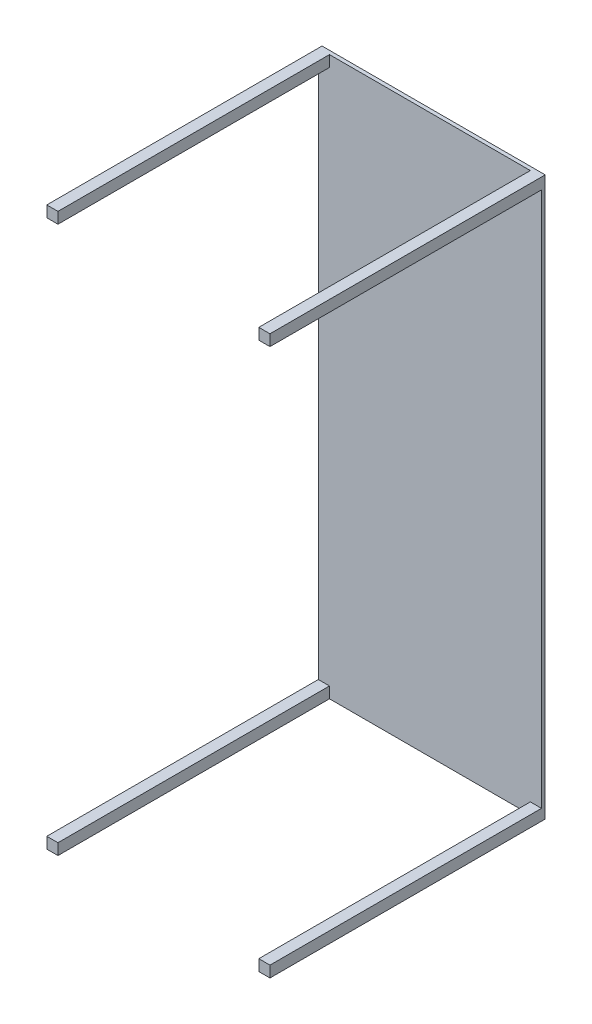
ISO-10303-21;
HEADER;
FILE_DESCRIPTION(('STEP AP214'),'2;1');
FILE_NAME('part.step','',(''),(''),'','','');
FILE_SCHEMA(('AUTOMOTIVE_DESIGN { 1 0 10303 214 1 1 1 1 }'));
ENDSEC;
DATA;
#1=APPLICATION_CONTEXT('core data for automotive mechanical design processes');
#2=APPLICATION_PROTOCOL_DEFINITION('international standard','automotive_design',2000,#1);
#3=PRODUCT_CONTEXT('',#1,'mechanical');
#4=PRODUCT('Part','Part','',(#3));
#5=PRODUCT_RELATED_PRODUCT_CATEGORY('part','',(#4));
#6=PRODUCT_DEFINITION_FORMATION('','',#4);
#7=PRODUCT_DEFINITION_CONTEXT('part definition',#1,'design');
#8=PRODUCT_DEFINITION('design','',#6,#7);
#9=PRODUCT_DEFINITION_SHAPE('','',#8);
#10=(LENGTH_UNIT() NAMED_UNIT(*) SI_UNIT(.MILLI.,.METRE.));
#11=(NAMED_UNIT(*) PLANE_ANGLE_UNIT() SI_UNIT($,.RADIAN.));
#12=(NAMED_UNIT(*) SI_UNIT($,.STERADIAN.) SOLID_ANGLE_UNIT());
#13=UNCERTAINTY_MEASURE_WITH_UNIT(LENGTH_MEASURE(1.E-05),#10,'distance_accuracy_value','');
#14=(GEOMETRIC_REPRESENTATION_CONTEXT(3) GLOBAL_UNCERTAINTY_ASSIGNED_CONTEXT((#13)) GLOBAL_UNIT_ASSIGNED_CONTEXT((#10,
#11,#12)) REPRESENTATION_CONTEXT('',''));
#15=CARTESIAN_POINT('',(0.,0.,0.));
#16=DIRECTION('',(0.,0.,1.));
#17=DIRECTION('',(1.,0.,0.));
#18=AXIS2_PLACEMENT_3D('',#15,#16,#17);
#19=CARTESIAN_POINT('',(0.,0.,10.));
#20=DIRECTION('',(0.,0.,1.));
#21=DIRECTION('',(1.,0.,0.));
#22=AXIS2_PLACEMENT_3D('',#19,#20,#21);
#23=PLANE('',#22);
#24=DIRECTION('',(-1.,0.,0.));
#25=VECTOR('',#24,1.);
#26=CARTESIAN_POINT('',(-300.,-720.,10.));
#27=LINE('',#26,#25);
#28=CARTESIAN_POINT('',(-270.,-720.,10.));
#29=VERTEX_POINT('',#28);
#30=CARTESIAN_POINT('',(-300.,-720.,10.));
#31=VERTEX_POINT('',#30);
#32=EDGE_CURVE('E50',#29,#31,#27,.T.);
#33=ORIENTED_EDGE('',*,*,#32,.F.);
#34=DIRECTION('',(0.,1.,0.));
#35=VECTOR('',#34,1.);
#36=CARTESIAN_POINT('',(-270.,-720.,10.));
#37=LINE('',#36,#35);
#38=CARTESIAN_POINT('',(-270.,-750.,10.));
#39=VERTEX_POINT('',#38);
#40=EDGE_CURVE('E174',#39,#29,#37,.T.);
#41=ORIENTED_EDGE('',*,*,#40,.F.);
#42=DIRECTION('',(1.,0.,0.));
#43=VECTOR('',#42,1.);
#44=CARTESIAN_POINT('',(-300.,-750.,10.));
#45=LINE('',#44,#43);
#46=CARTESIAN_POINT('',(270.,-750.,10.));
#47=VERTEX_POINT('',#46);
#48=EDGE_CURVE('E282',#39,#47,#45,.T.);
#49=ORIENTED_EDGE('',*,*,#48,.T.);
#50=DIRECTION('',(0.,-1.,0.));
#51=VECTOR('',#50,1.);
#52=CARTESIAN_POINT('',(270.,-720.,10.));
#53=LINE('',#52,#51);
#54=CARTESIAN_POINT('',(270.,-720.,10.));
#55=VERTEX_POINT('',#54);
#56=EDGE_CURVE('E186',#55,#47,#53,.T.);
#57=ORIENTED_EDGE('',*,*,#56,.F.);
#58=DIRECTION('',(-1.,0.,0.));
#59=VECTOR('',#58,1.);
#60=CARTESIAN_POINT('',(270.,-720.,10.));
#61=LINE('',#60,#59);
#62=CARTESIAN_POINT('',(300.,-720.,10.));
#63=VERTEX_POINT('',#62);
#64=EDGE_CURVE('E191',#63,#55,#61,.T.);
#65=ORIENTED_EDGE('',*,*,#64,.F.);
#66=DIRECTION('',(0.,1.,0.));
#67=VECTOR('',#66,1.);
#68=CARTESIAN_POINT('',(300.,750.,10.));
#69=LINE('',#68,#67);
#70=CARTESIAN_POINT('',(300.,720.,10.));
#71=VERTEX_POINT('',#70);
#72=EDGE_CURVE('E292',#63,#71,#69,.T.);
#73=ORIENTED_EDGE('',*,*,#72,.T.);
#74=DIRECTION('',(1.,0.,0.));
#75=VECTOR('',#74,1.);
#76=CARTESIAN_POINT('',(270.,720.,10.));
#77=LINE('',#76,#75);
#78=CARTESIAN_POINT('',(270.,720.,10.));
#79=VERTEX_POINT('',#78);
#80=EDGE_CURVE('E216',#79,#71,#77,.T.);
#81=ORIENTED_EDGE('',*,*,#80,.F.);
#82=DIRECTION('',(0.,-1.,0.));
#83=VECTOR('',#82,1.);
#84=CARTESIAN_POINT('',(270.,750.,10.));
#85=LINE('',#84,#83);
#86=CARTESIAN_POINT('',(270.,750.,10.));
#87=VERTEX_POINT('',#86);
#88=EDGE_CURVE('E211',#87,#79,#85,.T.);
#89=ORIENTED_EDGE('',*,*,#88,.F.);
#90=DIRECTION('',(-1.,0.,0.));
#91=VECTOR('',#90,1.);
#92=CARTESIAN_POINT('',(-300.,750.,10.));
#93=LINE('',#92,#91);
#94=CARTESIAN_POINT('',(-270.,750.,10.));
#95=VERTEX_POINT('',#94);
#96=EDGE_CURVE('E36',#87,#95,#93,.T.);
#97=ORIENTED_EDGE('',*,*,#96,.T.);
#98=DIRECTION('',(0.,1.,0.));
#99=VECTOR('',#98,1.);
#100=CARTESIAN_POINT('',(-270.,750.,10.));
#101=LINE('',#100,#99);
#102=CARTESIAN_POINT('',(-270.,720.,10.));
#103=VERTEX_POINT('',#102);
#104=EDGE_CURVE('E241',#103,#95,#101,.T.);
#105=ORIENTED_EDGE('',*,*,#104,.F.);
#106=DIRECTION('',(1.,0.,0.));
#107=VECTOR('',#106,1.);
#108=CARTESIAN_POINT('',(-300.,720.,10.));
#109=LINE('',#108,#107);
#110=CARTESIAN_POINT('',(-300.,720.,10.));
#111=VERTEX_POINT('',#110);
#112=EDGE_CURVE('E236',#111,#103,#109,.T.);
#113=ORIENTED_EDGE('',*,*,#112,.F.);
#114=DIRECTION('',(0.,-1.,0.));
#115=VECTOR('',#114,1.);
#116=CARTESIAN_POINT('',(-300.,750.,10.));
#117=LINE('',#116,#115);
#118=EDGE_CURVE('E55',#111,#31,#117,.T.);
#119=ORIENTED_EDGE('',*,*,#118,.T.);
#120=EDGE_LOOP('',(#33,#41,#49,#57,#65,#73,#81,#89,#97,#105,#113,#119));
#121=FACE_BOUND('',#120,.T.);
#122=ADVANCED_FACE('F32',(#121),#23,.T.);
#123=CARTESIAN_POINT('',(300.,750.,10.));
#124=DIRECTION('',(-1.,0.,0.));
#125=DIRECTION('',(0.,-1.,0.));
#126=AXIS2_PLACEMENT_3D('',#123,#124,#125);
#127=PLANE('',#126);
#128=DIRECTION('',(0.,1.,0.));
#129=VECTOR('',#128,1.);
#130=CARTESIAN_POINT('',(300.,750.,0.));
#131=LINE('',#130,#129);
#132=CARTESIAN_POINT('',(300.,-750.,0.));
#133=VERTEX_POINT('',#132);
#134=CARTESIAN_POINT('',(300.,750.,0.));
#135=VERTEX_POINT('',#134);
#136=EDGE_CURVE('E270',#133,#135,#131,.T.);
#137=ORIENTED_EDGE('',*,*,#136,.T.);
#138=DIRECTION('',(0.,0.,-1.));
#139=VECTOR('',#138,1.);
#140=CARTESIAN_POINT('',(300.,750.,10.));
#141=LINE('',#140,#139);
#142=CARTESIAN_POINT('',(300.,750.,740.));
#143=VERTEX_POINT('',#142);
#144=EDGE_CURVE('E11',#143,#135,#141,.T.);
#145=ORIENTED_EDGE('',*,*,#144,.F.);
#146=DIRECTION('',(0.,1.,0.));
#147=VECTOR('',#146,1.);
#148=CARTESIAN_POINT('',(300.,750.,740.));
#149=LINE('',#148,#147);
#150=CARTESIAN_POINT('',(300.,720.,740.));
#151=VERTEX_POINT('',#150);
#152=EDGE_CURVE('E218',#151,#143,#149,.T.);
#153=ORIENTED_EDGE('',*,*,#152,.F.);
#154=DIRECTION('',(0.,0.,-1.));
#155=VECTOR('',#154,1.);
#156=CARTESIAN_POINT('',(300.,720.,740.));
#157=LINE('',#156,#155);
#158=EDGE_CURVE('E230',#151,#71,#157,.T.);
#159=ORIENTED_EDGE('',*,*,#158,.T.);
#160=ORIENTED_EDGE('',*,*,#72,.F.);
#161=DIRECTION('',(0.,0.,-1.));
#162=VECTOR('',#161,1.);
#163=CARTESIAN_POINT('',(300.,-720.,740.));
#164=LINE('',#163,#162);
#165=CARTESIAN_POINT('',(300.,-720.,740.));
#166=VERTEX_POINT('',#165);
#167=EDGE_CURVE('E205',#166,#63,#164,.T.);
#168=ORIENTED_EDGE('',*,*,#167,.F.);
#169=DIRECTION('',(0.,1.,0.));
#170=VECTOR('',#169,1.);
#171=CARTESIAN_POINT('',(300.,-720.,740.));
#172=LINE('',#171,#170);
#173=CARTESIAN_POINT('',(300.,-750.,740.));
#174=VERTEX_POINT('',#173);
#175=EDGE_CURVE('E194',#174,#166,#172,.T.);
#176=ORIENTED_EDGE('',*,*,#175,.F.);
#177=DIRECTION('',(0.,0.,-1.));
#178=VECTOR('',#177,1.);
#179=CARTESIAN_POINT('',(300.,-750.,10.));
#180=LINE('',#179,#178);
#181=EDGE_CURVE('E158',#174,#133,#180,.T.);
#182=ORIENTED_EDGE('',*,*,#181,.T.);
#183=EDGE_LOOP('',(#137,#145,#153,#159,#160,#168,#176,#182));
#184=FACE_BOUND('',#183,.T.);
#185=ADVANCED_FACE('F34',(#184),#127,.F.);
#186=CARTESIAN_POINT('',(-300.,750.,10.));
#187=DIRECTION('',(0.,-1.,0.));
#188=DIRECTION('',(0.,0.,-1.));
#189=AXIS2_PLACEMENT_3D('',#186,#187,#188);
#190=PLANE('',#189);
#191=DIRECTION('',(-1.,0.,0.));
#192=VECTOR('',#191,1.);
#193=CARTESIAN_POINT('',(-300.,750.,0.));
#194=LINE('',#193,#192);
#195=CARTESIAN_POINT('',(-300.,750.,0.));
#196=VERTEX_POINT('',#195);
#197=EDGE_CURVE('E275',#135,#196,#194,.T.);
#198=ORIENTED_EDGE('',*,*,#197,.T.);
#199=DIRECTION('',(0.,0.,-1.));
#200=VECTOR('',#199,1.);
#201=CARTESIAN_POINT('',(-300.,750.,10.));
#202=LINE('',#201,#200);
#203=CARTESIAN_POINT('',(-300.,750.,740.));
#204=VERTEX_POINT('',#203);
#205=EDGE_CURVE('E42',#204,#196,#202,.T.);
#206=ORIENTED_EDGE('',*,*,#205,.F.);
#207=DIRECTION('',(-1.,0.,0.));
#208=VECTOR('',#207,1.);
#209=CARTESIAN_POINT('',(-300.,750.,740.));
#210=LINE('',#209,#208);
#211=CARTESIAN_POINT('',(-270.,750.,740.));
#212=VERTEX_POINT('',#211);
#213=EDGE_CURVE('E245',#212,#204,#210,.T.);
#214=ORIENTED_EDGE('',*,*,#213,.F.);
#215=DIRECTION('',(0.,0.,-1.));
#216=VECTOR('',#215,1.);
#217=CARTESIAN_POINT('',(-270.,750.,740.));
#218=LINE('',#217,#216);
#219=EDGE_CURVE('E248',#212,#95,#218,.T.);
#220=ORIENTED_EDGE('',*,*,#219,.T.);
#221=ORIENTED_EDGE('',*,*,#96,.F.);
#222=DIRECTION('',(0.,0.,-1.));
#223=VECTOR('',#222,1.);
#224=CARTESIAN_POINT('',(270.,750.,740.));
#225=LINE('',#224,#223);
#226=CARTESIAN_POINT('',(270.,750.,740.));
#227=VERTEX_POINT('',#226);
#228=EDGE_CURVE('E223',#227,#87,#225,.T.);
#229=ORIENTED_EDGE('',*,*,#228,.F.);
#230=DIRECTION('',(-1.,0.,0.));
#231=VECTOR('',#230,1.);
#232=CARTESIAN_POINT('',(270.,750.,740.));
#233=LINE('',#232,#231);
#234=EDGE_CURVE('E221',#143,#227,#233,.T.);
#235=ORIENTED_EDGE('',*,*,#234,.F.);
#236=ORIENTED_EDGE('',*,*,#144,.T.);
#237=EDGE_LOOP('',(#198,#206,#214,#220,#221,#229,#235,#236));
#238=FACE_BOUND('',#237,.T.);
#239=ADVANCED_FACE('F327',(#238),#190,.F.);
#240=CARTESIAN_POINT('',(-300.,750.,10.));
#241=DIRECTION('',(1.,0.,0.));
#242=DIRECTION('',(0.,1.,0.));
#243=AXIS2_PLACEMENT_3D('',#240,#241,#242);
#244=PLANE('',#243);
#245=DIRECTION('',(0.,-1.,0.));
#246=VECTOR('',#245,1.);
#247=CARTESIAN_POINT('',(-300.,750.,0.));
#248=LINE('',#247,#246);
#249=CARTESIAN_POINT('',(-300.,-750.,0.));
#250=VERTEX_POINT('',#249);
#251=EDGE_CURVE('E155',#196,#250,#248,.T.);
#252=ORIENTED_EDGE('',*,*,#251,.T.);
#253=DIRECTION('',(0.,0.,-1.));
#254=VECTOR('',#253,1.);
#255=CARTESIAN_POINT('',(-300.,-750.,10.));
#256=LINE('',#255,#254);
#257=CARTESIAN_POINT('',(-300.,-750.,740.));
#258=VERTEX_POINT('',#257);
#259=EDGE_CURVE('E147',#258,#250,#256,.T.);
#260=ORIENTED_EDGE('',*,*,#259,.F.);
#261=DIRECTION('',(0.,-1.,0.));
#262=VECTOR('',#261,1.);
#263=CARTESIAN_POINT('',(-300.,-720.,740.));
#264=LINE('',#263,#262);
#265=CARTESIAN_POINT('',(-300.,-720.,740.));
#266=VERTEX_POINT('',#265);
#267=EDGE_CURVE('E152',#266,#258,#264,.T.);
#268=ORIENTED_EDGE('',*,*,#267,.F.);
#269=DIRECTION('',(0.,0.,-1.));
#270=VECTOR('',#269,1.);
#271=CARTESIAN_POINT('',(-300.,-720.,740.));
#272=LINE('',#271,#270);
#273=EDGE_CURVE('E179',#266,#31,#272,.T.);
#274=ORIENTED_EDGE('',*,*,#273,.T.);
#275=ORIENTED_EDGE('',*,*,#118,.F.);
#276=DIRECTION('',(0.,0.,-1.));
#277=VECTOR('',#276,1.);
#278=CARTESIAN_POINT('',(-300.,720.,740.));
#279=LINE('',#278,#277);
#280=CARTESIAN_POINT('',(-300.,720.,740.));
#281=VERTEX_POINT('',#280);
#282=EDGE_CURVE('E265',#281,#111,#279,.T.);
#283=ORIENTED_EDGE('',*,*,#282,.F.);
#284=DIRECTION('',(0.,-1.,0.));
#285=VECTOR('',#284,1.);
#286=CARTESIAN_POINT('',(-300.,750.,740.));
#287=LINE('',#286,#285);
#288=EDGE_CURVE('E237',#204,#281,#287,.T.);
#289=ORIENTED_EDGE('',*,*,#288,.F.);
#290=ORIENTED_EDGE('',*,*,#205,.T.);
#291=EDGE_LOOP('',(#252,#260,#268,#274,#275,#283,#289,#290));
#292=FACE_BOUND('',#291,.T.);
#293=ADVANCED_FACE('F149',(#292),#244,.F.);
#294=CARTESIAN_POINT('',(-300.,-750.,10.));
#295=DIRECTION('',(0.,1.,0.));
#296=DIRECTION('',(0.,0.,1.));
#297=AXIS2_PLACEMENT_3D('',#294,#295,#296);
#298=PLANE('',#297);
#299=DIRECTION('',(1.,0.,0.));
#300=VECTOR('',#299,1.);
#301=CARTESIAN_POINT('',(-300.,-750.,0.));
#302=LINE('',#301,#300);
#303=EDGE_CURVE('E290',#250,#133,#302,.T.);
#304=ORIENTED_EDGE('',*,*,#303,.T.);
#305=ORIENTED_EDGE('',*,*,#181,.F.);
#306=DIRECTION('',(1.,0.,0.));
#307=VECTOR('',#306,1.);
#308=CARTESIAN_POINT('',(270.,-750.,740.));
#309=LINE('',#308,#307);
#310=CARTESIAN_POINT('',(270.,-750.,740.));
#311=VERTEX_POINT('',#310);
#312=EDGE_CURVE('E190',#311,#174,#309,.T.);
#313=ORIENTED_EDGE('',*,*,#312,.F.);
#314=DIRECTION('',(0.,0.,-1.));
#315=VECTOR('',#314,1.);
#316=CARTESIAN_POINT('',(270.,-750.,740.));
#317=LINE('',#316,#315);
#318=EDGE_CURVE('E208',#311,#47,#317,.T.);
#319=ORIENTED_EDGE('',*,*,#318,.T.);
#320=ORIENTED_EDGE('',*,*,#48,.F.);
#321=DIRECTION('',(0.,0.,-1.));
#322=VECTOR('',#321,1.);
#323=CARTESIAN_POINT('',(-270.,-750.,740.));
#324=LINE('',#323,#322);
#325=CARTESIAN_POINT('',(-270.,-750.,740.));
#326=VERTEX_POINT('',#325);
#327=EDGE_CURVE('E164',#326,#39,#324,.T.);
#328=ORIENTED_EDGE('',*,*,#327,.F.);
#329=DIRECTION('',(1.,0.,0.));
#330=VECTOR('',#329,1.);
#331=CARTESIAN_POINT('',(-300.,-750.,740.));
#332=LINE('',#331,#330);
#333=EDGE_CURVE('E161',#258,#326,#332,.T.);
#334=ORIENTED_EDGE('',*,*,#333,.F.);
#335=ORIENTED_EDGE('',*,*,#259,.T.);
#336=EDGE_LOOP('',(#304,#305,#313,#319,#320,#328,#334,#335));
#337=FACE_BOUND('',#336,.T.);
#338=ADVANCED_FACE('F162',(#337),#298,.F.);
#339=CARTESIAN_POINT('',(0.,0.,0.));
#340=DIRECTION('',(0.,0.,1.));
#341=DIRECTION('',(1.,0.,0.));
#342=AXIS2_PLACEMENT_3D('',#339,#340,#341);
#343=PLANE('',#342);
#344=ORIENTED_EDGE('',*,*,#136,.F.);
#345=ORIENTED_EDGE('',*,*,#303,.F.);
#346=ORIENTED_EDGE('',*,*,#251,.F.);
#347=ORIENTED_EDGE('',*,*,#197,.F.);
#348=EDGE_LOOP('',(#344,#345,#346,#347));
#349=FACE_BOUND('',#348,.T.);
#350=ADVANCED_FACE('F297',(#349),#343,.F.);
#351=CARTESIAN_POINT('',(-300.,720.,740.));
#352=DIRECTION('',(0.,1.,0.));
#353=DIRECTION('',(0.,0.,1.));
#354=AXIS2_PLACEMENT_3D('',#351,#352,#353);
#355=PLANE('',#354);
#356=ORIENTED_EDGE('',*,*,#112,.T.);
#357=DIRECTION('',(0.,0.,-1.));
#358=VECTOR('',#357,1.);
#359=CARTESIAN_POINT('',(-270.,720.,740.));
#360=LINE('',#359,#358);
#361=CARTESIAN_POINT('',(-270.,720.,740.));
#362=VERTEX_POINT('',#361);
#363=EDGE_CURVE('E251',#362,#103,#360,.T.);
#364=ORIENTED_EDGE('',*,*,#363,.F.);
#365=DIRECTION('',(1.,0.,0.));
#366=VECTOR('',#365,1.);
#367=CARTESIAN_POINT('',(-300.,720.,740.));
#368=LINE('',#367,#366);
#369=EDGE_CURVE('E240',#281,#362,#368,.T.);
#370=ORIENTED_EDGE('',*,*,#369,.F.);
#371=ORIENTED_EDGE('',*,*,#282,.T.);
#372=EDGE_LOOP('',(#356,#364,#370,#371));
#373=FACE_BOUND('',#372,.T.);
#374=ADVANCED_FACE('F330',(#373),#355,.F.);
#375=CARTESIAN_POINT('',(-270.,750.,740.));
#376=DIRECTION('',(-1.,0.,0.));
#377=DIRECTION('',(0.,0.,1.));
#378=AXIS2_PLACEMENT_3D('',#375,#376,#377);
#379=PLANE('',#378);
#380=ORIENTED_EDGE('',*,*,#104,.T.);
#381=ORIENTED_EDGE('',*,*,#219,.F.);
#382=DIRECTION('',(0.,1.,0.));
#383=VECTOR('',#382,1.);
#384=CARTESIAN_POINT('',(-270.,750.,740.));
#385=LINE('',#384,#383);
#386=EDGE_CURVE('E243',#362,#212,#385,.T.);
#387=ORIENTED_EDGE('',*,*,#386,.F.);
#388=ORIENTED_EDGE('',*,*,#363,.T.);
#389=EDGE_LOOP('',(#380,#381,#387,#388));
#390=FACE_BOUND('',#389,.T.);
#391=ADVANCED_FACE('F350',(#390),#379,.F.);
#392=CARTESIAN_POINT('',(0.,0.,740.));
#393=DIRECTION('',(0.,0.,1.));
#394=DIRECTION('',(1.,0.,0.));
#395=AXIS2_PLACEMENT_3D('',#392,#393,#394);
#396=PLANE('',#395);
#397=ORIENTED_EDGE('',*,*,#288,.T.);
#398=ORIENTED_EDGE('',*,*,#369,.T.);
#399=ORIENTED_EDGE('',*,*,#386,.T.);
#400=ORIENTED_EDGE('',*,*,#213,.T.);
#401=EDGE_LOOP('',(#397,#398,#399,#400));
#402=FACE_BOUND('',#401,.T.);
#403=ADVANCED_FACE('F352',(#402),#396,.T.);
#404=CARTESIAN_POINT('',(270.,750.,740.));
#405=DIRECTION('',(1.,0.,0.));
#406=DIRECTION('',(0.,0.,-1.));
#407=AXIS2_PLACEMENT_3D('',#404,#405,#406);
#408=PLANE('',#407);
#409=ORIENTED_EDGE('',*,*,#88,.T.);
#410=DIRECTION('',(0.,0.,-1.));
#411=VECTOR('',#410,1.);
#412=CARTESIAN_POINT('',(270.,720.,740.));
#413=LINE('',#412,#411);
#414=CARTESIAN_POINT('',(270.,720.,740.));
#415=VERTEX_POINT('',#414);
#416=EDGE_CURVE('E233',#415,#79,#413,.T.);
#417=ORIENTED_EDGE('',*,*,#416,.F.);
#418=DIRECTION('',(0.,-1.,0.));
#419=VECTOR('',#418,1.);
#420=CARTESIAN_POINT('',(270.,750.,740.));
#421=LINE('',#420,#419);
#422=EDGE_CURVE('E212',#227,#415,#421,.T.);
#423=ORIENTED_EDGE('',*,*,#422,.F.);
#424=ORIENTED_EDGE('',*,*,#228,.T.);
#425=EDGE_LOOP('',(#409,#417,#423,#424));
#426=FACE_BOUND('',#425,.T.);
#427=ADVANCED_FACE('F408',(#426),#408,.F.);
#428=CARTESIAN_POINT('',(270.,720.,740.));
#429=DIRECTION('',(0.,1.,0.));
#430=DIRECTION('',(0.,0.,1.));
#431=AXIS2_PLACEMENT_3D('',#428,#429,#430);
#432=PLANE('',#431);
#433=ORIENTED_EDGE('',*,*,#80,.T.);
#434=ORIENTED_EDGE('',*,*,#158,.F.);
#435=DIRECTION('',(1.,0.,0.));
#436=VECTOR('',#435,1.);
#437=CARTESIAN_POINT('',(270.,720.,740.));
#438=LINE('',#437,#436);
#439=EDGE_CURVE('E215',#415,#151,#438,.T.);
#440=ORIENTED_EDGE('',*,*,#439,.F.);
#441=ORIENTED_EDGE('',*,*,#416,.T.);
#442=EDGE_LOOP('',(#433,#434,#440,#441));
#443=FACE_BOUND('',#442,.T.);
#444=ADVANCED_FACE('F348',(#443),#432,.F.);
#445=CARTESIAN_POINT('',(0.,0.,740.));
#446=DIRECTION('',(0.,0.,1.));
#447=DIRECTION('',(1.,0.,0.));
#448=AXIS2_PLACEMENT_3D('',#445,#446,#447);
#449=PLANE('',#448);
#450=ORIENTED_EDGE('',*,*,#422,.T.);
#451=ORIENTED_EDGE('',*,*,#439,.T.);
#452=ORIENTED_EDGE('',*,*,#152,.T.);
#453=ORIENTED_EDGE('',*,*,#234,.T.);
#454=EDGE_LOOP('',(#450,#451,#452,#453));
#455=FACE_BOUND('',#454,.T.);
#456=ADVANCED_FACE('F320',(#455),#449,.T.);
#457=CARTESIAN_POINT('',(270.,-720.,740.));
#458=DIRECTION('',(1.,0.,0.));
#459=DIRECTION('',(0.,0.,-1.));
#460=AXIS2_PLACEMENT_3D('',#457,#458,#459);
#461=PLANE('',#460);
#462=ORIENTED_EDGE('',*,*,#56,.T.);
#463=ORIENTED_EDGE('',*,*,#318,.F.);
#464=DIRECTION('',(0.,-1.,0.));
#465=VECTOR('',#464,1.);
#466=CARTESIAN_POINT('',(270.,-720.,740.));
#467=LINE('',#466,#465);
#468=CARTESIAN_POINT('',(270.,-720.,740.));
#469=VERTEX_POINT('',#468);
#470=EDGE_CURVE('E187',#469,#311,#467,.T.);
#471=ORIENTED_EDGE('',*,*,#470,.F.);
#472=DIRECTION('',(0.,0.,-1.));
#473=VECTOR('',#472,1.);
#474=CARTESIAN_POINT('',(270.,-720.,740.));
#475=LINE('',#474,#473);
#476=EDGE_CURVE('E198',#469,#55,#475,.T.);
#477=ORIENTED_EDGE('',*,*,#476,.T.);
#478=EDGE_LOOP('',(#462,#463,#471,#477));
#479=FACE_BOUND('',#478,.T.);
#480=ADVANCED_FACE('F309',(#479),#461,.F.);
#481=CARTESIAN_POINT('',(270.,-720.,740.));
#482=DIRECTION('',(0.,-1.,0.));
#483=DIRECTION('',(0.,0.,-1.));
#484=AXIS2_PLACEMENT_3D('',#481,#482,#483);
#485=PLANE('',#484);
#486=ORIENTED_EDGE('',*,*,#64,.T.);
#487=ORIENTED_EDGE('',*,*,#476,.F.);
#488=DIRECTION('',(-1.,0.,0.));
#489=VECTOR('',#488,1.);
#490=CARTESIAN_POINT('',(270.,-720.,740.));
#491=LINE('',#490,#489);
#492=EDGE_CURVE('E196',#166,#469,#491,.T.);
#493=ORIENTED_EDGE('',*,*,#492,.F.);
#494=ORIENTED_EDGE('',*,*,#167,.T.);
#495=EDGE_LOOP('',(#486,#487,#493,#494));
#496=FACE_BOUND('',#495,.T.);
#497=ADVANCED_FACE('F311',(#496),#485,.F.);
#498=CARTESIAN_POINT('',(0.,0.,740.));
#499=DIRECTION('',(0.,0.,1.));
#500=DIRECTION('',(1.,0.,0.));
#501=AXIS2_PLACEMENT_3D('',#498,#499,#500);
#502=PLANE('',#501);
#503=ORIENTED_EDGE('',*,*,#470,.T.);
#504=ORIENTED_EDGE('',*,*,#312,.T.);
#505=ORIENTED_EDGE('',*,*,#175,.T.);
#506=ORIENTED_EDGE('',*,*,#492,.T.);
#507=EDGE_LOOP('',(#503,#504,#505,#506));
#508=FACE_BOUND('',#507,.T.);
#509=ADVANCED_FACE('F304',(#508),#502,.T.);
#510=CARTESIAN_POINT('',(-270.,-720.,740.));
#511=DIRECTION('',(-1.,0.,0.));
#512=DIRECTION('',(0.,0.,1.));
#513=AXIS2_PLACEMENT_3D('',#510,#511,#512);
#514=PLANE('',#513);
#515=ORIENTED_EDGE('',*,*,#40,.T.);
#516=DIRECTION('',(0.,0.,-1.));
#517=VECTOR('',#516,1.);
#518=CARTESIAN_POINT('',(-270.,-720.,740.));
#519=LINE('',#518,#517);
#520=CARTESIAN_POINT('',(-270.,-720.,740.));
#521=VERTEX_POINT('',#520);
#522=EDGE_CURVE('E182',#521,#29,#519,.T.);
#523=ORIENTED_EDGE('',*,*,#522,.F.);
#524=DIRECTION('',(0.,1.,0.));
#525=VECTOR('',#524,1.);
#526=CARTESIAN_POINT('',(-270.,-720.,740.));
#527=LINE('',#526,#525);
#528=EDGE_CURVE('E167',#326,#521,#527,.T.);
#529=ORIENTED_EDGE('',*,*,#528,.F.);
#530=ORIENTED_EDGE('',*,*,#327,.T.);
#531=EDGE_LOOP('',(#515,#523,#529,#530));
#532=FACE_BOUND('',#531,.T.);
#533=ADVANCED_FACE('F318',(#532),#514,.F.);
#534=CARTESIAN_POINT('',(-300.,-720.,740.));
#535=DIRECTION('',(0.,-1.,0.));
#536=DIRECTION('',(0.,0.,-1.));
#537=AXIS2_PLACEMENT_3D('',#534,#535,#536);
#538=PLANE('',#537);
#539=ORIENTED_EDGE('',*,*,#32,.T.);
#540=ORIENTED_EDGE('',*,*,#273,.F.);
#541=DIRECTION('',(-1.,0.,0.));
#542=VECTOR('',#541,1.);
#543=CARTESIAN_POINT('',(-300.,-720.,740.));
#544=LINE('',#543,#542);
#545=EDGE_CURVE('E171',#521,#266,#544,.T.);
#546=ORIENTED_EDGE('',*,*,#545,.F.);
#547=ORIENTED_EDGE('',*,*,#522,.T.);
#548=EDGE_LOOP('',(#539,#540,#546,#547));
#549=FACE_BOUND('',#548,.T.);
#550=ADVANCED_FACE('F354',(#549),#538,.F.);
#551=CARTESIAN_POINT('',(0.,0.,740.));
#552=DIRECTION('',(0.,0.,1.));
#553=DIRECTION('',(1.,0.,0.));
#554=AXIS2_PLACEMENT_3D('',#551,#552,#553);
#555=PLANE('',#554);
#556=ORIENTED_EDGE('',*,*,#267,.T.);
#557=ORIENTED_EDGE('',*,*,#333,.T.);
#558=ORIENTED_EDGE('',*,*,#528,.T.);
#559=ORIENTED_EDGE('',*,*,#545,.T.);
#560=EDGE_LOOP('',(#556,#557,#558,#559));
#561=FACE_BOUND('',#560,.T.);
#562=ADVANCED_FACE('F169',(#561),#555,.T.);
#563=CLOSED_SHELL('',(#122,#185,#239,#293,#338,#350,#374,#391,#403,#427,#444,#456,#480,#497,
#509,#533,#550,#562));
#564=MANIFOLD_SOLID_BREP('B2',#563);
#565=ADVANCED_BREP_SHAPE_REPRESENTATION('',(#18,#564),#14);
#566=SHAPE_DEFINITION_REPRESENTATION(#9,#565);
ENDSEC;
END-ISO-10303-21;
